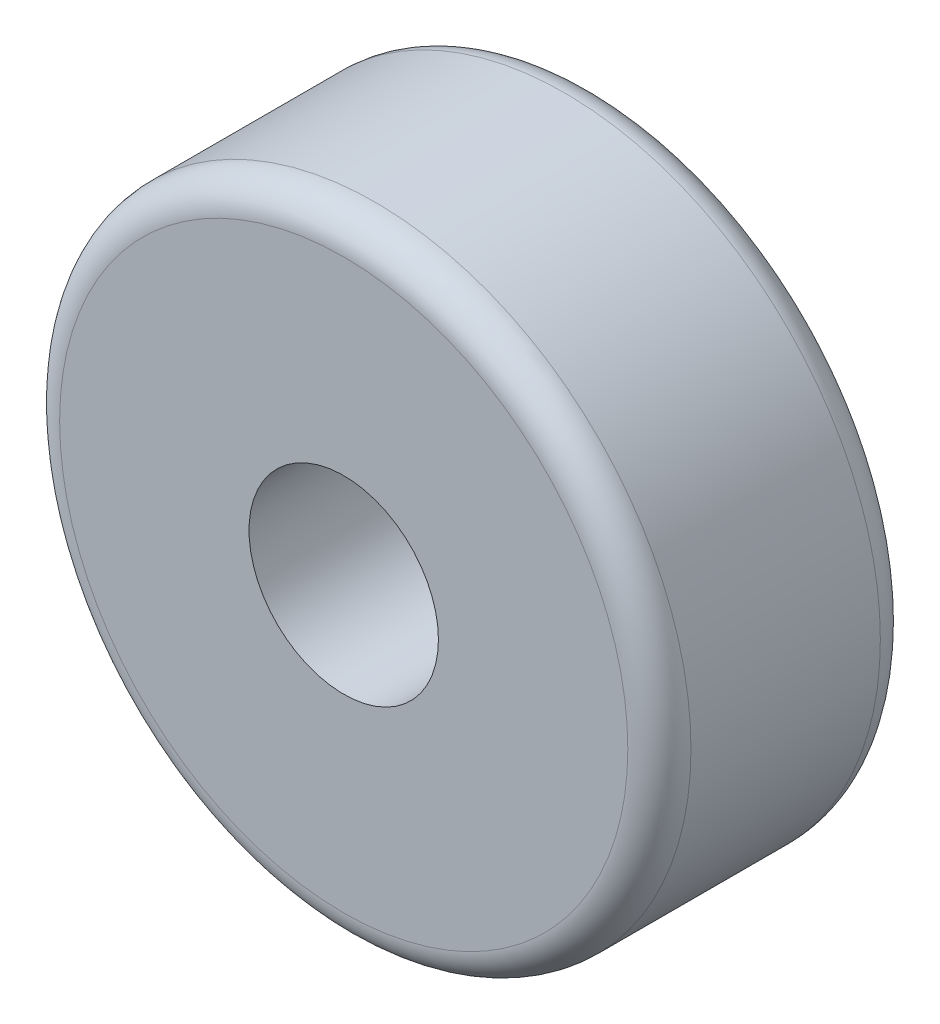
ISO-10303-21;
HEADER;
FILE_DESCRIPTION(('STEP AP214'),'2;1');
FILE_NAME('part.step','',(''),(''),'','','');
FILE_SCHEMA(('AUTOMOTIVE_DESIGN { 1 0 10303 214 1 1 1 1 }'));
ENDSEC;
DATA;
#1=APPLICATION_CONTEXT('core data for automotive mechanical design processes');
#2=APPLICATION_PROTOCOL_DEFINITION('international standard','automotive_design',2000,#1);
#3=PRODUCT_CONTEXT('',#1,'mechanical');
#4=PRODUCT('Part','Part','',(#3));
#5=PRODUCT_RELATED_PRODUCT_CATEGORY('part','',(#4));
#6=PRODUCT_DEFINITION_FORMATION('','',#4);
#7=PRODUCT_DEFINITION_CONTEXT('part definition',#1,'design');
#8=PRODUCT_DEFINITION('design','',#6,#7);
#9=PRODUCT_DEFINITION_SHAPE('','',#8);
#10=(LENGTH_UNIT() NAMED_UNIT(*) SI_UNIT(.MILLI.,.METRE.));
#11=(NAMED_UNIT(*) PLANE_ANGLE_UNIT() SI_UNIT($,.RADIAN.));
#12=(NAMED_UNIT(*) SI_UNIT($,.STERADIAN.) SOLID_ANGLE_UNIT());
#13=UNCERTAINTY_MEASURE_WITH_UNIT(LENGTH_MEASURE(1.E-05),#10,'distance_accuracy_value','');
#14=(GEOMETRIC_REPRESENTATION_CONTEXT(3) GLOBAL_UNCERTAINTY_ASSIGNED_CONTEXT((#13)) GLOBAL_UNIT_ASSIGNED_CONTEXT((#10,
#11,#12)) REPRESENTATION_CONTEXT('',''));
#15=CARTESIAN_POINT('',(0.,0.,0.));
#16=DIRECTION('',(0.,0.,1.));
#17=DIRECTION('',(1.,0.,0.));
#18=AXIS2_PLACEMENT_3D('',#15,#16,#17);
#19=CARTESIAN_POINT('',(0.,0.,4.));
#20=DIRECTION('',(0.,0.,1.));
#21=DIRECTION('',(1.,0.,0.));
#22=AXIS2_PLACEMENT_3D('',#19,#20,#21);
#23=PLANE('',#22);
#24=CARTESIAN_POINT('',(0.,0.,4.));
#25=DIRECTION('',(0.,0.,1.));
#26=DIRECTION('',(1.,0.,0.));
#27=AXIS2_PLACEMENT_3D('',#24,#25,#26);
#28=CIRCLE('',#27,4.5);
#29=CARTESIAN_POINT('',(4.5,0.,4.));
#30=VERTEX_POINT('',#29);
#31=EDGE_CURVE('E10',#30,#30,#28,.T.);
#32=ORIENTED_EDGE('',*,*,#31,.T.);
#33=EDGE_LOOP('',(#32));
#34=FACE_BOUND('',#33,.T.);
#35=CARTESIAN_POINT('',(0.,0.,4.));
#36=DIRECTION('',(0.,0.,1.));
#37=DIRECTION('',(1.,0.,0.));
#38=AXIS2_PLACEMENT_3D('',#35,#36,#37);
#39=CIRCLE('',#38,1.5);
#40=CARTESIAN_POINT('',(1.5,0.,4.));
#41=VERTEX_POINT('',#40);
#42=EDGE_CURVE('E51',#41,#41,#39,.T.);
#43=ORIENTED_EDGE('',*,*,#42,.F.);
#44=EDGE_LOOP('',(#43));
#45=FACE_BOUND('',#44,.T.);
#46=ADVANCED_FACE('F31',(#34,#45),#23,.T.);
#47=CARTESIAN_POINT('',(0.,0.,0.));
#48=DIRECTION('',(0.,0.,1.));
#49=DIRECTION('',(1.,0.,0.));
#50=AXIS2_PLACEMENT_3D('',#47,#48,#49);
#51=PLANE('',#50);
#52=CARTESIAN_POINT('',(0.,0.,0.));
#53=DIRECTION('',(0.,0.,1.));
#54=DIRECTION('',(1.,0.,0.));
#55=AXIS2_PLACEMENT_3D('',#52,#53,#54);
#56=CIRCLE('',#55,4.5);
#57=CARTESIAN_POINT('',(4.5,0.,0.));
#58=VERTEX_POINT('',#57);
#59=EDGE_CURVE('E38',#58,#58,#56,.F.);
#60=ORIENTED_EDGE('',*,*,#59,.T.);
#61=EDGE_LOOP('',(#60));
#62=FACE_BOUND('',#61,.T.);
#63=CARTESIAN_POINT('',(0.,0.,0.));
#64=DIRECTION('',(0.,0.,1.));
#65=DIRECTION('',(1.,0.,0.));
#66=AXIS2_PLACEMENT_3D('',#63,#64,#65);
#67=CIRCLE('',#66,1.5);
#68=CARTESIAN_POINT('',(1.5,0.,0.));
#69=VERTEX_POINT('',#68);
#70=EDGE_CURVE('E52',#69,#69,#67,.T.);
#71=ORIENTED_EDGE('',*,*,#70,.T.);
#72=EDGE_LOOP('',(#71));
#73=FACE_BOUND('',#72,.T.);
#74=ADVANCED_FACE('F62',(#62,#73),#51,.F.);
#75=CARTESIAN_POINT('',(0.,0.,4.));
#76=DIRECTION('',(0.,0.,-1.));
#77=DIRECTION('',(-1.,0.,0.));
#78=AXIS2_PLACEMENT_3D('',#75,#76,#77);
#79=CYLINDRICAL_SURFACE('',#78,5.);
#80=CARTESIAN_POINT('',(0.,0.,0.5));
#81=DIRECTION('',(0.,0.,1.));
#82=DIRECTION('',(1.,0.,0.));
#83=AXIS2_PLACEMENT_3D('',#80,#81,#82);
#84=CIRCLE('',#83,5.);
#85=CARTESIAN_POINT('',(5.,0.,0.5));
#86=VERTEX_POINT('',#85);
#87=EDGE_CURVE('E42',#86,#86,#84,.T.);
#88=ORIENTED_EDGE('',*,*,#87,.T.);
#89=EDGE_LOOP('',(#88));
#90=FACE_BOUND('',#89,.T.);
#91=CARTESIAN_POINT('',(0.,0.,3.5));
#92=DIRECTION('',(0.,0.,1.));
#93=DIRECTION('',(1.,0.,0.));
#94=AXIS2_PLACEMENT_3D('',#91,#92,#93);
#95=CIRCLE('',#94,5.);
#96=CARTESIAN_POINT('',(5.,0.,3.5));
#97=VERTEX_POINT('',#96);
#98=EDGE_CURVE('E46',#97,#97,#95,.F.);
#99=ORIENTED_EDGE('',*,*,#98,.T.);
#100=EDGE_LOOP('',(#99));
#101=FACE_BOUND('',#100,.T.);
#102=ADVANCED_FACE('F67',(#90,#101),#79,.T.);
#103=CARTESIAN_POINT('',(0.,0.,4.));
#104=DIRECTION('',(0.,0.,-1.));
#105=DIRECTION('',(-1.,0.,0.));
#106=AXIS2_PLACEMENT_3D('',#103,#104,#105);
#107=CYLINDRICAL_SURFACE('',#106,1.5);
#108=ORIENTED_EDGE('',*,*,#42,.T.);
#109=EDGE_LOOP('',(#108));
#110=FACE_BOUND('',#109,.T.);
#111=ORIENTED_EDGE('',*,*,#70,.F.);
#112=EDGE_LOOP('',(#111));
#113=FACE_BOUND('',#112,.T.);
#114=ADVANCED_FACE('F58',(#110,#113),#107,.F.);
#115=CARTESIAN_POINT('',(0.,0.,0.5));
#116=DIRECTION('',(0.,0.,1.));
#117=DIRECTION('',(1.,0.,0.));
#118=AXIS2_PLACEMENT_3D('',#115,#116,#117);
#119=TOROIDAL_SURFACE('',#118,4.5,0.5);
#120=ORIENTED_EDGE('',*,*,#59,.F.);
#121=EDGE_LOOP('',(#120));
#122=FACE_BOUND('',#121,.T.);
#123=ORIENTED_EDGE('',*,*,#87,.F.);
#124=EDGE_LOOP('',(#123));
#125=FACE_BOUND('',#124,.T.);
#126=ADVANCED_FACE('F73',(#122,#125),#119,.T.);
#127=CARTESIAN_POINT('',(0.,0.,3.5));
#128=DIRECTION('',(0.,0.,1.));
#129=DIRECTION('',(1.,0.,0.));
#130=AXIS2_PLACEMENT_3D('',#127,#128,#129);
#131=TOROIDAL_SURFACE('',#130,4.5,0.5);
#132=ORIENTED_EDGE('',*,*,#98,.F.);
#133=EDGE_LOOP('',(#132));
#134=FACE_BOUND('',#133,.T.);
#135=ORIENTED_EDGE('',*,*,#31,.F.);
#136=EDGE_LOOP('',(#135));
#137=FACE_BOUND('',#136,.T.);
#138=ADVANCED_FACE('F33',(#134,#137),#131,.T.);
#139=CLOSED_SHELL('',(#46,#74,#102,#114,#126,#138));
#140=MANIFOLD_SOLID_BREP('B2',#139);
#141=ADVANCED_BREP_SHAPE_REPRESENTATION('',(#18,#140),#14);
#142=SHAPE_DEFINITION_REPRESENTATION(#9,#141);
ENDSEC;
END-ISO-10303-21;
